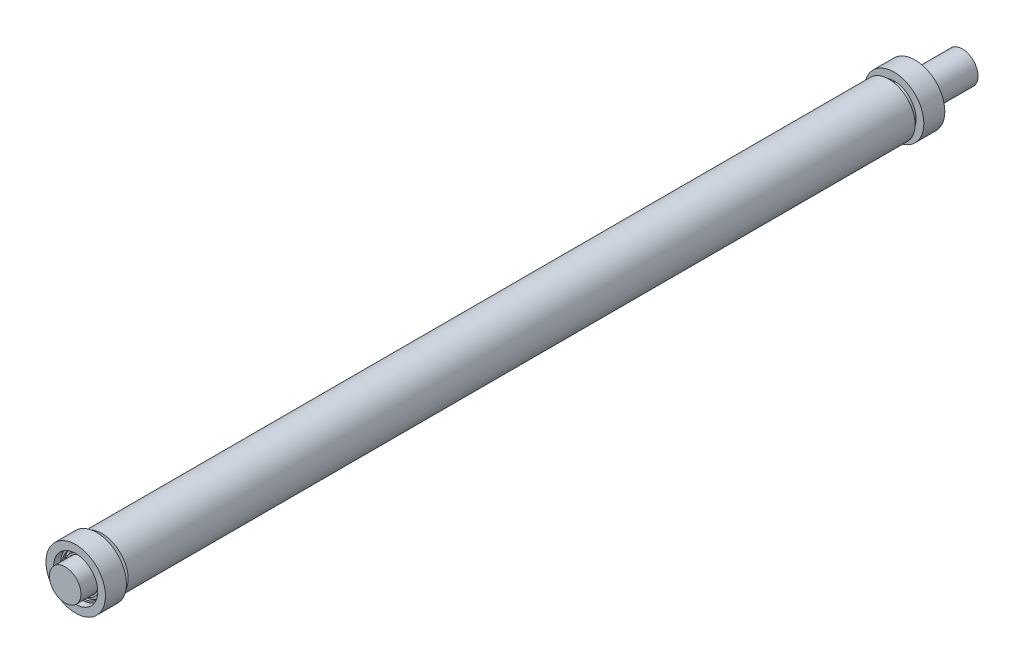
ISO-10303-21;
HEADER;
FILE_DESCRIPTION(('STEP AP214'),'2;1');
FILE_NAME('part.step','',(''),(''),'','','');
FILE_SCHEMA(('AUTOMOTIVE_DESIGN { 1 0 10303 214 1 1 1 1 }'));
ENDSEC;
DATA;
#1=APPLICATION_CONTEXT('core data for automotive mechanical design processes');
#2=APPLICATION_PROTOCOL_DEFINITION('international standard','automotive_design',2000,#1);
#3=PRODUCT_CONTEXT('',#1,'mechanical');
#4=PRODUCT('Part','Part','',(#3));
#5=PRODUCT_RELATED_PRODUCT_CATEGORY('part','',(#4));
#6=PRODUCT_DEFINITION_FORMATION('','',#4);
#7=PRODUCT_DEFINITION_CONTEXT('part definition',#1,'design');
#8=PRODUCT_DEFINITION('design','',#6,#7);
#9=PRODUCT_DEFINITION_SHAPE('','',#8);
#10=(LENGTH_UNIT() NAMED_UNIT(*) SI_UNIT(.MILLI.,.METRE.));
#11=(NAMED_UNIT(*) PLANE_ANGLE_UNIT() SI_UNIT($,.RADIAN.));
#12=(NAMED_UNIT(*) SI_UNIT($,.STERADIAN.) SOLID_ANGLE_UNIT());
#13=UNCERTAINTY_MEASURE_WITH_UNIT(LENGTH_MEASURE(1.E-05),#10,'distance_accuracy_value','');
#14=(GEOMETRIC_REPRESENTATION_CONTEXT(3) GLOBAL_UNCERTAINTY_ASSIGNED_CONTEXT((#13)) GLOBAL_UNIT_ASSIGNED_CONTEXT((#10,
#11,#12)) REPRESENTATION_CONTEXT('',''));
#15=CARTESIAN_POINT('',(0.,0.,0.));
#16=DIRECTION('',(0.,0.,1.));
#17=DIRECTION('',(1.,0.,0.));
#18=AXIS2_PLACEMENT_3D('',#15,#16,#17);
#19=CARTESIAN_POINT('',(0.,0.,750.));
#20=DIRECTION('',(0.,0.,-1.));
#21=DIRECTION('',(-1.,0.,0.));
#22=AXIS2_PLACEMENT_3D('',#19,#20,#21);
#23=CYLINDRICAL_SURFACE('',#22,25.);
#24=CARTESIAN_POINT('',(0.,0.,750.));
#25=DIRECTION('',(0.,0.,1.));
#26=DIRECTION('',(1.,0.,0.));
#27=AXIS2_PLACEMENT_3D('',#24,#25,#26);
#28=CIRCLE('',#27,25.);
#29=CARTESIAN_POINT('',(25.,0.,750.));
#30=VERTEX_POINT('',#29);
#31=EDGE_CURVE('P0_E27',#30,#30,#28,.T.);
#32=ORIENTED_EDGE('',*,*,#31,.F.);
#33=EDGE_LOOP('',(#32));
#34=FACE_BOUND('',#33,.T.);
#35=CARTESIAN_POINT('',(0.,0.,0.));
#36=DIRECTION('',(0.,0.,1.));
#37=DIRECTION('',(1.,0.,0.));
#38=AXIS2_PLACEMENT_3D('',#35,#36,#37);
#39=CIRCLE('',#38,25.);
#40=CARTESIAN_POINT('',(25.,0.,0.));
#41=VERTEX_POINT('',#40);
#42=EDGE_CURVE('P0_E18',#41,#41,#39,.T.);
#43=ORIENTED_EDGE('',*,*,#42,.T.);
#44=EDGE_LOOP('',(#43));
#45=FACE_BOUND('',#44,.T.);
#46=ADVANCED_FACE('P0_F15',(#34,#45),#23,.T.);
#47=CARTESIAN_POINT('',(0.,0.,750.));
#48=DIRECTION('',(0.,0.,1.));
#49=DIRECTION('',(1.,0.,0.));
#50=AXIS2_PLACEMENT_3D('',#47,#48,#49);
#51=PLANE('',#50);
#52=CARTESIAN_POINT('',(0.,0.,750.));
#53=DIRECTION('',(0.,0.,1.));
#54=DIRECTION('',(1.,0.,0.));
#55=AXIS2_PLACEMENT_3D('',#52,#53,#54);
#56=CIRCLE('',#55,15.);
#57=CARTESIAN_POINT('',(15.,0.,750.));
#58=VERTEX_POINT('',#57);
#59=EDGE_CURVE('P0_E10',#58,#58,#56,.T.);
#60=ORIENTED_EDGE('',*,*,#59,.F.);
#61=EDGE_LOOP('',(#60));
#62=FACE_BOUND('',#61,.T.);
#63=ORIENTED_EDGE('',*,*,#31,.T.);
#64=EDGE_LOOP('',(#63));
#65=FACE_BOUND('',#64,.T.);
#66=ADVANCED_FACE('P0_F44',(#62,#65),#51,.T.);
#67=CARTESIAN_POINT('',(0.,0.,0.));
#68=DIRECTION('',(0.,0.,1.));
#69=DIRECTION('',(1.,0.,0.));
#70=AXIS2_PLACEMENT_3D('',#67,#68,#69);
#71=PLANE('',#70);
#72=CARTESIAN_POINT('',(0.,0.,0.));
#73=DIRECTION('',(0.,0.,-1.));
#74=DIRECTION('',(-1.,0.,0.));
#75=AXIS2_PLACEMENT_3D('',#72,#73,#74);
#76=CIRCLE('',#75,15.);
#77=CARTESIAN_POINT('',(-15.,0.,0.));
#78=VERTEX_POINT('',#77);
#79=EDGE_CURVE('P0_E22',#78,#78,#76,.T.);
#80=ORIENTED_EDGE('',*,*,#79,.F.);
#81=EDGE_LOOP('',(#80));
#82=FACE_BOUND('',#81,.T.);
#83=ORIENTED_EDGE('',*,*,#42,.F.);
#84=EDGE_LOOP('',(#83));
#85=FACE_BOUND('',#84,.T.);
#86=ADVANCED_FACE('P0_F41',(#82,#85),#71,.F.);
#87=CARTESIAN_POINT('',(0.,0.,-70.));
#88=DIRECTION('',(0.,0.,1.));
#89=DIRECTION('',(1.,0.,0.));
#90=AXIS2_PLACEMENT_3D('',#87,#88,#89);
#91=CYLINDRICAL_SURFACE('',#90,15.);
#92=CARTESIAN_POINT('',(0.,0.,-70.));
#93=DIRECTION('',(0.,0.,-1.));
#94=DIRECTION('',(-1.,0.,0.));
#95=AXIS2_PLACEMENT_3D('',#92,#93,#94);
#96=CIRCLE('',#95,15.);
#97=CARTESIAN_POINT('',(-15.,0.,-70.));
#98=VERTEX_POINT('',#97);
#99=EDGE_CURVE('P0_E32',#98,#98,#96,.T.);
#100=ORIENTED_EDGE('',*,*,#99,.F.);
#101=EDGE_LOOP('',(#100));
#102=FACE_BOUND('',#101,.T.);
#103=ORIENTED_EDGE('',*,*,#79,.T.);
#104=EDGE_LOOP('',(#103));
#105=FACE_BOUND('',#104,.T.);
#106=ADVANCED_FACE('P0_F43',(#102,#105),#91,.T.);
#107=CARTESIAN_POINT('',(0.,0.,-70.));
#108=DIRECTION('',(0.,0.,-1.));
#109=DIRECTION('',(-1.,0.,0.));
#110=AXIS2_PLACEMENT_3D('',#107,#108,#109);
#111=PLANE('',#110);
#112=ORIENTED_EDGE('',*,*,#99,.T.);
#113=EDGE_LOOP('',(#112));
#114=FACE_BOUND('',#113,.T.);
#115=ADVANCED_FACE('P0_F51',(#114),#111,.T.);
#116=CARTESIAN_POINT('',(0.,0.,785.));
#117=DIRECTION('',(0.,0.,-1.));
#118=DIRECTION('',(-1.,0.,0.));
#119=AXIS2_PLACEMENT_3D('',#116,#117,#118);
#120=CYLINDRICAL_SURFACE('',#119,15.);
#121=CARTESIAN_POINT('',(0.,0.,785.));
#122=DIRECTION('',(0.,0.,1.));
#123=DIRECTION('',(1.,0.,0.));
#124=AXIS2_PLACEMENT_3D('',#121,#122,#123);
#125=CIRCLE('',#124,15.);
#126=CARTESIAN_POINT('',(15.,0.,785.));
#127=VERTEX_POINT('',#126);
#128=EDGE_CURVE('P0_E31',#127,#127,#125,.T.);
#129=ORIENTED_EDGE('',*,*,#128,.F.);
#130=EDGE_LOOP('',(#129));
#131=FACE_BOUND('',#130,.T.);
#132=ORIENTED_EDGE('',*,*,#59,.T.);
#133=EDGE_LOOP('',(#132));
#134=FACE_BOUND('',#133,.T.);
#135=ADVANCED_FACE('P0_F91',(#131,#134),#120,.T.);
#136=CARTESIAN_POINT('',(0.,0.,785.));
#137=DIRECTION('',(0.,0.,1.));
#138=DIRECTION('',(1.,0.,0.));
#139=AXIS2_PLACEMENT_3D('',#136,#137,#138);
#140=PLANE('',#139);
#141=ORIENTED_EDGE('',*,*,#128,.T.);
#142=EDGE_LOOP('',(#141));
#143=FACE_BOUND('',#142,.T.);
#144=ADVANCED_FACE('P0_F101',(#143),#140,.T.);
#145=CLOSED_SHELL('',(#46,#66,#86,#106,#115,#135,#144));
#146=MANIFOLD_SOLID_BREP('P0_B1',#145);
#147=CARTESIAN_POINT('',(0.,0.,-15.));
#148=DIRECTION('',(0.,0.,-1.));
#149=DIRECTION('',(-1.,0.,0.));
#150=AXIS2_PLACEMENT_3D('',#147,#148,#149);
#151=TOROIDAL_SURFACE('',#150,18.,1.8);
#152=CARTESIAN_POINT('',(0.,0.,-13.6583592135001));
#153=DIRECTION('',(0.,0.,-1.));
#154=DIRECTION('',(-1.,0.,0.));
#155=AXIS2_PLACEMENT_3D('',#152,#153,#154);
#156=CIRCLE('',#155,19.2);
#157=CARTESIAN_POINT('',(-19.2,0.,-13.6583592135001));
#158=VERTEX_POINT('',#157);
#159=EDGE_CURVE('P1_E18',#158,#158,#156,.F.);
#160=ORIENTED_EDGE('',*,*,#159,.T.);
#161=EDGE_LOOP('',(#160));
#162=FACE_BOUND('',#161,.T.);
#163=CARTESIAN_POINT('',(0.,0.,-13.6583592135001));
#164=DIRECTION('',(0.,0.,-1.));
#165=DIRECTION('',(-1.,0.,0.));
#166=AXIS2_PLACEMENT_3D('',#163,#164,#165);
#167=CIRCLE('',#166,16.8);
#168=CARTESIAN_POINT('',(-16.8,0.,-13.6583592135001));
#169=VERTEX_POINT('',#168);
#170=EDGE_CURVE('P1_E9',#169,#169,#167,.T.);
#171=ORIENTED_EDGE('',*,*,#170,.T.);
#172=EDGE_LOOP('',(#171));
#173=FACE_BOUND('',#172,.T.);
#174=ADVANCED_FACE('P1_F14',(#162,#173),#151,.T.);
#175=CARTESIAN_POINT('',(0.,0.,-35.6375));
#176=DIRECTION('',(0.,0.,1.));
#177=DIRECTION('',(1.,0.,0.));
#178=AXIS2_PLACEMENT_3D('',#175,#176,#177);
#179=CYLINDRICAL_SURFACE('',#178,16.8);
#180=CARTESIAN_POINT('',(0.,0.,-11.5));
#181=DIRECTION('',(0.,0.,1.));
#182=DIRECTION('',(1.,0.,0.));
#183=AXIS2_PLACEMENT_3D('',#180,#181,#182);
#184=CIRCLE('',#183,16.8);
#185=CARTESIAN_POINT('',(16.8,0.,-11.5));
#186=VERTEX_POINT('',#185);
#187=EDGE_CURVE('P1_E27',#186,#186,#184,.T.);
#188=ORIENTED_EDGE('',*,*,#187,.F.);
#189=EDGE_LOOP('',(#188));
#190=FACE_BOUND('',#189,.T.);
#191=ORIENTED_EDGE('',*,*,#170,.F.);
#192=EDGE_LOOP('',(#191));
#193=FACE_BOUND('',#192,.T.);
#194=ADVANCED_FACE('P1_F66',(#190,#193),#179,.T.);
#195=CARTESIAN_POINT('',(0.,0.,-35.6375));
#196=DIRECTION('',(0.,0.,1.));
#197=DIRECTION('',(1.,0.,0.));
#198=AXIS2_PLACEMENT_3D('',#195,#196,#197);
#199=CYLINDRICAL_SURFACE('',#198,16.8);
#200=CARTESIAN_POINT('',(0.,0.,-18.5));
#201=DIRECTION('',(0.,0.,1.));
#202=DIRECTION('',(1.,0.,0.));
#203=AXIS2_PLACEMENT_3D('',#200,#201,#202);
#204=CIRCLE('',#203,16.8);
#205=CARTESIAN_POINT('',(16.8,0.,-18.5));
#206=VERTEX_POINT('',#205);
#207=EDGE_CURVE('P1_E36',#206,#206,#204,.T.);
#208=ORIENTED_EDGE('',*,*,#207,.T.);
#209=EDGE_LOOP('',(#208));
#210=FACE_BOUND('',#209,.T.);
#211=CARTESIAN_POINT('',(0.,0.,-16.3416407864999));
#212=DIRECTION('',(0.,0.,1.));
#213=DIRECTION('',(1.,0.,0.));
#214=AXIS2_PLACEMENT_3D('',#211,#212,#213);
#215=CIRCLE('',#214,16.8);
#216=CARTESIAN_POINT('',(16.8,0.,-16.3416407864999));
#217=VERTEX_POINT('',#216);
#218=EDGE_CURVE('P1_E22',#217,#217,#215,.T.);
#219=ORIENTED_EDGE('',*,*,#218,.F.);
#220=EDGE_LOOP('',(#219));
#221=FACE_BOUND('',#220,.T.);
#222=ADVANCED_FACE('P1_F69',(#210,#221),#199,.T.);
#223=CARTESIAN_POINT('',(0.,15.3,-11.5));
#224=DIRECTION('',(0.,0.,1.));
#225=DIRECTION('',(1.,0.,0.));
#226=AXIS2_PLACEMENT_3D('',#223,#224,#225);
#227=PLANE('',#226);
#228=ORIENTED_EDGE('',*,*,#187,.T.);
#229=EDGE_LOOP('',(#228));
#230=FACE_BOUND('',#229,.T.);
#231=CARTESIAN_POINT('',(0.,0.,-11.5));
#232=DIRECTION('',(0.,0.,1.));
#233=DIRECTION('',(1.,0.,0.));
#234=AXIS2_PLACEMENT_3D('',#231,#232,#233);
#235=CIRCLE('',#234,15.3);
#236=CARTESIAN_POINT('',(15.3,0.,-11.5));
#237=VERTEX_POINT('',#236);
#238=EDGE_CURVE('P1_E58',#237,#237,#235,.T.);
#239=ORIENTED_EDGE('',*,*,#238,.F.);
#240=EDGE_LOOP('',(#239));
#241=FACE_BOUND('',#240,.T.);
#242=ADVANCED_FACE('P1_F63',(#230,#241),#227,.T.);
#243=CARTESIAN_POINT('',(0.,0.,-11.8));
#244=DIRECTION('',(0.,0.,1.));
#245=DIRECTION('',(1.,0.,0.));
#246=AXIS2_PLACEMENT_3D('',#243,#244,#245);
#247=TOROIDAL_SURFACE('',#246,15.3,0.3);
#248=ORIENTED_EDGE('',*,*,#238,.T.);
#249=EDGE_LOOP('',(#248));
#250=FACE_BOUND('',#249,.T.);
#251=CARTESIAN_POINT('',(0.,0.,-11.8));
#252=DIRECTION('',(0.,0.,1.));
#253=DIRECTION('',(1.,0.,0.));
#254=AXIS2_PLACEMENT_3D('',#251,#252,#253);
#255=CIRCLE('',#254,15.);
#256=CARTESIAN_POINT('',(15.,0.,-11.8));
#257=VERTEX_POINT('',#256);
#258=EDGE_CURVE('P1_E55',#257,#257,#255,.T.);
#259=ORIENTED_EDGE('',*,*,#258,.F.);
#260=EDGE_LOOP('',(#259));
#261=FACE_BOUND('',#260,.T.);
#262=ADVANCED_FACE('P1_F81',(#250,#261),#247,.T.);
#263=CARTESIAN_POINT('',(0.,0.,-35.6375));
#264=DIRECTION('',(0.,0.,1.));
#265=DIRECTION('',(1.,0.,0.));
#266=AXIS2_PLACEMENT_3D('',#263,#264,#265);
#267=CYLINDRICAL_SURFACE('',#266,15.);
#268=ORIENTED_EDGE('',*,*,#258,.T.);
#269=EDGE_LOOP('',(#268));
#270=FACE_BOUND('',#269,.T.);
#271=CARTESIAN_POINT('',(0.,0.,-18.2));
#272=DIRECTION('',(0.,0.,1.));
#273=DIRECTION('',(1.,0.,0.));
#274=AXIS2_PLACEMENT_3D('',#271,#272,#273);
#275=CIRCLE('',#274,15.);
#276=CARTESIAN_POINT('',(15.,0.,-18.2));
#277=VERTEX_POINT('',#276);
#278=EDGE_CURVE('P1_E52',#277,#277,#275,.T.);
#279=ORIENTED_EDGE('',*,*,#278,.F.);
#280=EDGE_LOOP('',(#279));
#281=FACE_BOUND('',#280,.T.);
#282=ADVANCED_FACE('P1_F84',(#270,#281),#267,.F.);
#283=CARTESIAN_POINT('',(0.,0.,-18.2));
#284=DIRECTION('',(0.,0.,1.));
#285=DIRECTION('',(1.,0.,0.));
#286=AXIS2_PLACEMENT_3D('',#283,#284,#285);
#287=TOROIDAL_SURFACE('',#286,15.3,0.3);
#288=ORIENTED_EDGE('',*,*,#278,.T.);
#289=EDGE_LOOP('',(#288));
#290=FACE_BOUND('',#289,.T.);
#291=CARTESIAN_POINT('',(0.,0.,-18.5));
#292=DIRECTION('',(0.,0.,1.));
#293=DIRECTION('',(1.,0.,0.));
#294=AXIS2_PLACEMENT_3D('',#291,#292,#293);
#295=CIRCLE('',#294,15.3);
#296=CARTESIAN_POINT('',(15.3,0.,-18.5));
#297=VERTEX_POINT('',#296);
#298=EDGE_CURVE('P1_E49',#297,#297,#295,.T.);
#299=ORIENTED_EDGE('',*,*,#298,.F.);
#300=EDGE_LOOP('',(#299));
#301=FACE_BOUND('',#300,.T.);
#302=ADVANCED_FACE('P1_F88',(#290,#301),#287,.T.);
#303=CARTESIAN_POINT('',(0.,16.8,-18.5));
#304=DIRECTION('',(0.,0.,-1.));
#305=DIRECTION('',(-1.,0.,0.));
#306=AXIS2_PLACEMENT_3D('',#303,#304,#305);
#307=PLANE('',#306);
#308=ORIENTED_EDGE('',*,*,#298,.T.);
#309=EDGE_LOOP('',(#308));
#310=FACE_BOUND('',#309,.T.);
#311=ORIENTED_EDGE('',*,*,#207,.F.);
#312=EDGE_LOOP('',(#311));
#313=FACE_BOUND('',#312,.T.);
#314=ADVANCED_FACE('P1_F92',(#310,#313),#307,.T.);
#315=CARTESIAN_POINT('',(0.,0.,-16.3416407864999));
#316=DIRECTION('',(0.,0.,1.));
#317=DIRECTION('',(1.,0.,0.));
#318=AXIS2_PLACEMENT_3D('',#315,#316,#317);
#319=CIRCLE('',#318,19.2);
#320=CARTESIAN_POINT('',(19.2,0.,-16.3416407864999));
#321=VERTEX_POINT('',#320);
#322=EDGE_CURVE('P1_E30',#321,#321,#319,.F.);
#323=ORIENTED_EDGE('',*,*,#322,.T.);
#324=EDGE_LOOP('',(#323));
#325=FACE_BOUND('',#324,.T.);
#326=ORIENTED_EDGE('',*,*,#218,.T.);
#327=EDGE_LOOP('',(#326));
#328=FACE_BOUND('',#327,.T.);
#329=ADVANCED_FACE('P1_F16',(#325,#328),#151,.T.);
#330=CARTESIAN_POINT('',(0.,0.,-35.6375));
#331=DIRECTION('',(0.,0.,1.));
#332=DIRECTION('',(1.,0.,0.));
#333=AXIS2_PLACEMENT_3D('',#330,#331,#332);
#334=CYLINDRICAL_SURFACE('',#333,19.2);
#335=CARTESIAN_POINT('',(0.,0.,-11.5));
#336=DIRECTION('',(0.,0.,1.));
#337=DIRECTION('',(1.,0.,0.));
#338=AXIS2_PLACEMENT_3D('',#335,#336,#337);
#339=CIRCLE('',#338,19.2);
#340=CARTESIAN_POINT('',(19.2,0.,-11.5));
#341=VERTEX_POINT('',#340);
#342=EDGE_CURVE('P1_E32',#341,#341,#339,.T.);
#343=ORIENTED_EDGE('',*,*,#342,.T.);
#344=EDGE_LOOP('',(#343));
#345=FACE_BOUND('',#344,.T.);
#346=ORIENTED_EDGE('',*,*,#159,.F.);
#347=EDGE_LOOP('',(#346));
#348=FACE_BOUND('',#347,.T.);
#349=ADVANCED_FACE('P1_F97',(#345,#348),#334,.F.);
#350=CARTESIAN_POINT('',(0.,0.,-35.6375));
#351=DIRECTION('',(0.,0.,1.));
#352=DIRECTION('',(1.,0.,0.));
#353=AXIS2_PLACEMENT_3D('',#350,#351,#352);
#354=CYLINDRICAL_SURFACE('',#353,19.2);
#355=CARTESIAN_POINT('',(0.,0.,-18.5));
#356=DIRECTION('',(0.,0.,1.));
#357=DIRECTION('',(1.,0.,0.));
#358=AXIS2_PLACEMENT_3D('',#355,#356,#357);
#359=CIRCLE('',#358,19.2);
#360=CARTESIAN_POINT('',(19.2,0.,-18.5));
#361=VERTEX_POINT('',#360);
#362=EDGE_CURVE('P1_E128',#361,#361,#359,.T.);
#363=ORIENTED_EDGE('',*,*,#362,.F.);
#364=EDGE_LOOP('',(#363));
#365=FACE_BOUND('',#364,.T.);
#366=ORIENTED_EDGE('',*,*,#322,.F.);
#367=EDGE_LOOP('',(#366));
#368=FACE_BOUND('',#367,.T.);
#369=ADVANCED_FACE('P1_F100',(#365,#368),#354,.F.);
#370=CARTESIAN_POINT('',(0.,20.7,-11.5));
#371=DIRECTION('',(0.,0.,1.));
#372=DIRECTION('',(1.,0.,0.));
#373=AXIS2_PLACEMENT_3D('',#370,#371,#372);
#374=PLANE('',#373);
#375=CARTESIAN_POINT('',(0.,0.,-11.5));
#376=DIRECTION('',(0.,0.,1.));
#377=DIRECTION('',(1.,0.,0.));
#378=AXIS2_PLACEMENT_3D('',#375,#376,#377);
#379=CIRCLE('',#378,20.7);
#380=CARTESIAN_POINT('',(20.7,0.,-11.5));
#381=VERTEX_POINT('',#380);
#382=EDGE_CURVE('P1_E38',#381,#381,#379,.T.);
#383=ORIENTED_EDGE('',*,*,#382,.T.);
#384=EDGE_LOOP('',(#383));
#385=FACE_BOUND('',#384,.T.);
#386=ORIENTED_EDGE('',*,*,#342,.F.);
#387=EDGE_LOOP('',(#386));
#388=FACE_BOUND('',#387,.T.);
#389=ADVANCED_FACE('P1_F101',(#385,#388),#374,.T.);
#390=CARTESIAN_POINT('',(0.,0.,-11.8));
#391=DIRECTION('',(0.,0.,1.));
#392=DIRECTION('',(1.,0.,0.));
#393=AXIS2_PLACEMENT_3D('',#390,#391,#392);
#394=TOROIDAL_SURFACE('',#393,20.7,0.299999999999996);
#395=CARTESIAN_POINT('',(0.,0.,-11.8));
#396=DIRECTION('',(0.,0.,1.));
#397=DIRECTION('',(1.,0.,0.));
#398=AXIS2_PLACEMENT_3D('',#395,#396,#397);
#399=CIRCLE('',#398,21.);
#400=CARTESIAN_POINT('',(21.,0.,-11.8));
#401=VERTEX_POINT('',#400);
#402=EDGE_CURVE('P1_E43',#401,#401,#399,.T.);
#403=ORIENTED_EDGE('',*,*,#402,.T.);
#404=EDGE_LOOP('',(#403));
#405=FACE_BOUND('',#404,.T.);
#406=ORIENTED_EDGE('',*,*,#382,.F.);
#407=EDGE_LOOP('',(#406));
#408=FACE_BOUND('',#407,.T.);
#409=ADVANCED_FACE('P1_F104',(#405,#408),#394,.T.);
#410=CARTESIAN_POINT('',(0.,0.,-35.6375));
#411=DIRECTION('',(0.,0.,1.));
#412=DIRECTION('',(1.,0.,0.));
#413=AXIS2_PLACEMENT_3D('',#410,#411,#412);
#414=CYLINDRICAL_SURFACE('',#413,21.);
#415=CARTESIAN_POINT('',(0.,0.,-18.2));
#416=DIRECTION('',(0.,0.,1.));
#417=DIRECTION('',(1.,0.,0.));
#418=AXIS2_PLACEMENT_3D('',#415,#416,#417);
#419=CIRCLE('',#418,21.);
#420=CARTESIAN_POINT('',(21.,0.,-18.2));
#421=VERTEX_POINT('',#420);
#422=EDGE_CURVE('P1_E132',#421,#421,#419,.T.);
#423=ORIENTED_EDGE('',*,*,#422,.T.);
#424=EDGE_LOOP('',(#423));
#425=FACE_BOUND('',#424,.T.);
#426=ORIENTED_EDGE('',*,*,#402,.F.);
#427=EDGE_LOOP('',(#426));
#428=FACE_BOUND('',#427,.T.);
#429=ADVANCED_FACE('P1_F108',(#425,#428),#414,.T.);
#430=CARTESIAN_POINT('',(0.,0.,-18.2));
#431=DIRECTION('',(0.,0.,1.));
#432=DIRECTION('',(1.,0.,0.));
#433=AXIS2_PLACEMENT_3D('',#430,#431,#432);
#434=TOROIDAL_SURFACE('',#433,20.7,0.299999999999996);
#435=CARTESIAN_POINT('',(0.,0.,-18.5));
#436=DIRECTION('',(0.,0.,1.));
#437=DIRECTION('',(1.,0.,0.));
#438=AXIS2_PLACEMENT_3D('',#435,#436,#437);
#439=CIRCLE('',#438,20.7);
#440=CARTESIAN_POINT('',(20.7,0.,-18.5));
#441=VERTEX_POINT('',#440);
#442=EDGE_CURVE('P1_E129',#441,#441,#439,.T.);
#443=ORIENTED_EDGE('',*,*,#442,.T.);
#444=EDGE_LOOP('',(#443));
#445=FACE_BOUND('',#444,.T.);
#446=ORIENTED_EDGE('',*,*,#422,.F.);
#447=EDGE_LOOP('',(#446));
#448=FACE_BOUND('',#447,.T.);
#449=ADVANCED_FACE('P1_F112',(#445,#448),#434,.T.);
#450=CARTESIAN_POINT('',(0.,19.2,-18.5));
#451=DIRECTION('',(0.,0.,-1.));
#452=DIRECTION('',(-1.,0.,0.));
#453=AXIS2_PLACEMENT_3D('',#450,#451,#452);
#454=PLANE('',#453);
#455=ORIENTED_EDGE('',*,*,#362,.T.);
#456=EDGE_LOOP('',(#455));
#457=FACE_BOUND('',#456,.T.);
#458=ORIENTED_EDGE('',*,*,#442,.F.);
#459=EDGE_LOOP('',(#458));
#460=FACE_BOUND('',#459,.T.);
#461=ADVANCED_FACE('P1_F116',(#457,#460),#454,.T.);
#462=CLOSED_SHELL('',(#174,#194,#222,#242,#262,#282,#302,#314,#329,#349,#369,#389,#409,#429,
#449,#461));
#463=MANIFOLD_SOLID_BREP('P1_B1',#462);
#464=CARTESIAN_POINT('',(0.,0.,-5.));
#465=DIRECTION('',(0.,0.,1.));
#466=DIRECTION('',(1.,0.,0.));
#467=AXIS2_PLACEMENT_3D('',#464,#465,#466);
#468=PLANE('',#467);
#469=CARTESIAN_POINT('',(0.,0.,-5.));
#470=DIRECTION('',(0.,0.,1.));
#471=DIRECTION('',(1.,0.,0.));
#472=AXIS2_PLACEMENT_3D('',#469,#470,#471);
#473=CIRCLE('',#472,28.35);
#474=CARTESIAN_POINT('',(28.35,0.,-5.));
#475=VERTEX_POINT('',#474);
#476=EDGE_CURVE('P2_E10',#475,#475,#473,.T.);
#477=ORIENTED_EDGE('',*,*,#476,.T.);
#478=EDGE_LOOP('',(#477));
#479=FACE_BOUND('',#478,.T.);
#480=CARTESIAN_POINT('',(0.,0.,-5.));
#481=DIRECTION('',(0.,0.,1.));
#482=DIRECTION('',(1.,0.,0.));
#483=AXIS2_PLACEMENT_3D('',#480,#481,#482);
#484=CIRCLE('',#483,21.);
#485=CARTESIAN_POINT('',(21.,0.,-5.));
#486=VERTEX_POINT('',#485);
#487=EDGE_CURVE('P2_E26',#486,#486,#484,.T.);
#488=ORIENTED_EDGE('',*,*,#487,.F.);
#489=EDGE_LOOP('',(#488));
#490=FACE_BOUND('',#489,.T.);
#491=ADVANCED_FACE('P2_F15',(#479,#490),#468,.T.);
#492=CARTESIAN_POINT('',(0.,0.,-25.));
#493=DIRECTION('',(0.,0.,1.));
#494=DIRECTION('',(1.,0.,0.));
#495=AXIS2_PLACEMENT_3D('',#492,#493,#494);
#496=PLANE('',#495);
#497=CARTESIAN_POINT('',(0.,0.,-25.));
#498=DIRECTION('',(0.,0.,1.));
#499=DIRECTION('',(1.,0.,0.));
#500=AXIS2_PLACEMENT_3D('',#497,#498,#499);
#501=CIRCLE('',#500,28.35);
#502=CARTESIAN_POINT('',(28.35,0.,-25.));
#503=VERTEX_POINT('',#502);
#504=EDGE_CURVE('P2_E19',#503,#503,#501,.T.);
#505=ORIENTED_EDGE('',*,*,#504,.F.);
#506=EDGE_LOOP('',(#505));
#507=FACE_BOUND('',#506,.T.);
#508=CARTESIAN_POINT('',(0.,0.,-25.));
#509=DIRECTION('',(0.,0.,1.));
#510=DIRECTION('',(1.,0.,0.));
#511=AXIS2_PLACEMENT_3D('',#508,#509,#510);
#512=CIRCLE('',#511,21.);
#513=CARTESIAN_POINT('',(21.,0.,-25.));
#514=VERTEX_POINT('',#513);
#515=EDGE_CURVE('P2_E28',#514,#514,#512,.T.);
#516=ORIENTED_EDGE('',*,*,#515,.T.);
#517=EDGE_LOOP('',(#516));
#518=FACE_BOUND('',#517,.T.);
#519=ADVANCED_FACE('P2_F38',(#507,#518),#496,.F.);
#520=CARTESIAN_POINT('',(0.,0.,-5.));
#521=DIRECTION('',(0.,0.,-1.));
#522=DIRECTION('',(-1.,0.,0.));
#523=AXIS2_PLACEMENT_3D('',#520,#521,#522);
#524=CYLINDRICAL_SURFACE('',#523,28.35);
#525=ORIENTED_EDGE('',*,*,#476,.F.);
#526=EDGE_LOOP('',(#525));
#527=FACE_BOUND('',#526,.T.);
#528=ORIENTED_EDGE('',*,*,#504,.T.);
#529=EDGE_LOOP('',(#528));
#530=FACE_BOUND('',#529,.T.);
#531=ADVANCED_FACE('P2_F17',(#527,#530),#524,.T.);
#532=CARTESIAN_POINT('',(0.,0.,-5.));
#533=DIRECTION('',(0.,0.,-1.));
#534=DIRECTION('',(-1.,0.,0.));
#535=AXIS2_PLACEMENT_3D('',#532,#533,#534);
#536=CYLINDRICAL_SURFACE('',#535,21.);
#537=ORIENTED_EDGE('',*,*,#487,.T.);
#538=EDGE_LOOP('',(#537));
#539=FACE_BOUND('',#538,.T.);
#540=ORIENTED_EDGE('',*,*,#515,.F.);
#541=EDGE_LOOP('',(#540));
#542=FACE_BOUND('',#541,.T.);
#543=ADVANCED_FACE('P2_F34',(#539,#542),#536,.F.);
#544=CLOSED_SHELL('',(#491,#519,#531,#543));
#545=MANIFOLD_SOLID_BREP('P2_B1',#544);
#546=CARTESIAN_POINT('',(0.,0.,765.));
#547=DIRECTION('',(0.,0.,-1.));
#548=DIRECTION('',(-1.,0.,0.));
#549=AXIS2_PLACEMENT_3D('',#546,#547,#548);
#550=TOROIDAL_SURFACE('',#549,18.,1.8);
#551=CARTESIAN_POINT('',(0.,0.,766.3416407865));
#552=DIRECTION('',(0.,0.,-1.));
#553=DIRECTION('',(-1.,0.,0.));
#554=AXIS2_PLACEMENT_3D('',#551,#552,#553);
#555=CIRCLE('',#554,19.2);
#556=CARTESIAN_POINT('',(-19.2,0.,766.3416407865));
#557=VERTEX_POINT('',#556);
#558=EDGE_CURVE('P3_E19',#557,#557,#555,.F.);
#559=ORIENTED_EDGE('',*,*,#558,.T.);
#560=EDGE_LOOP('',(#559));
#561=FACE_BOUND('',#560,.T.);
#562=CARTESIAN_POINT('',(0.,0.,766.3416407865));
#563=DIRECTION('',(0.,0.,-1.));
#564=DIRECTION('',(-1.,0.,0.));
#565=AXIS2_PLACEMENT_3D('',#562,#563,#564);
#566=CIRCLE('',#565,16.8);
#567=CARTESIAN_POINT('',(-16.8,0.,766.3416407865));
#568=VERTEX_POINT('',#567);
#569=EDGE_CURVE('P3_E10',#568,#568,#566,.T.);
#570=ORIENTED_EDGE('',*,*,#569,.T.);
#571=EDGE_LOOP('',(#570));
#572=FACE_BOUND('',#571,.T.);
#573=ADVANCED_FACE('P3_F15',(#561,#572),#550,.T.);
#574=CARTESIAN_POINT('',(0.,0.,744.3625));
#575=DIRECTION('',(0.,0.,1.));
#576=DIRECTION('',(1.,0.,0.));
#577=AXIS2_PLACEMENT_3D('',#574,#575,#576);
#578=CYLINDRICAL_SURFACE('',#577,16.8);
#579=CARTESIAN_POINT('',(0.,0.,768.5));
#580=DIRECTION('',(0.,0.,1.));
#581=DIRECTION('',(1.,0.,0.));
#582=AXIS2_PLACEMENT_3D('',#579,#580,#581);
#583=CIRCLE('',#582,16.8);
#584=CARTESIAN_POINT('',(16.8,0.,768.5));
#585=VERTEX_POINT('',#584);
#586=EDGE_CURVE('P3_E28',#585,#585,#583,.T.);
#587=ORIENTED_EDGE('',*,*,#586,.F.);
#588=EDGE_LOOP('',(#587));
#589=FACE_BOUND('',#588,.T.);
#590=ORIENTED_EDGE('',*,*,#569,.F.);
#591=EDGE_LOOP('',(#590));
#592=FACE_BOUND('',#591,.T.);
#593=ADVANCED_FACE('P3_F67',(#589,#592),#578,.T.);
#594=CARTESIAN_POINT('',(0.,0.,744.3625));
#595=DIRECTION('',(0.,0.,1.));
#596=DIRECTION('',(1.,0.,0.));
#597=AXIS2_PLACEMENT_3D('',#594,#595,#596);
#598=CYLINDRICAL_SURFACE('',#597,16.8);
#599=CARTESIAN_POINT('',(0.,0.,761.5));
#600=DIRECTION('',(0.,0.,1.));
#601=DIRECTION('',(1.,0.,0.));
#602=AXIS2_PLACEMENT_3D('',#599,#600,#601);
#603=CIRCLE('',#602,16.8);
#604=CARTESIAN_POINT('',(16.8,0.,761.5));
#605=VERTEX_POINT('',#604);
#606=EDGE_CURVE('P3_E37',#605,#605,#603,.T.);
#607=ORIENTED_EDGE('',*,*,#606,.T.);
#608=EDGE_LOOP('',(#607));
#609=FACE_BOUND('',#608,.T.);
#610=CARTESIAN_POINT('',(0.,0.,763.6583592135));
#611=DIRECTION('',(0.,0.,1.));
#612=DIRECTION('',(1.,0.,0.));
#613=AXIS2_PLACEMENT_3D('',#610,#611,#612);
#614=CIRCLE('',#613,16.8);
#615=CARTESIAN_POINT('',(16.8,0.,763.6583592135));
#616=VERTEX_POINT('',#615);
#617=EDGE_CURVE('P3_E23',#616,#616,#614,.T.);
#618=ORIENTED_EDGE('',*,*,#617,.F.);
#619=EDGE_LOOP('',(#618));
#620=FACE_BOUND('',#619,.T.);
#621=ADVANCED_FACE('P3_F70',(#609,#620),#598,.T.);
#622=CARTESIAN_POINT('',(0.,15.3,768.5));
#623=DIRECTION('',(0.,0.,1.));
#624=DIRECTION('',(1.,0.,0.));
#625=AXIS2_PLACEMENT_3D('',#622,#623,#624);
#626=PLANE('',#625);
#627=ORIENTED_EDGE('',*,*,#586,.T.);
#628=EDGE_LOOP('',(#627));
#629=FACE_BOUND('',#628,.T.);
#630=CARTESIAN_POINT('',(0.,0.,768.5));
#631=DIRECTION('',(0.,0.,1.));
#632=DIRECTION('',(1.,0.,0.));
#633=AXIS2_PLACEMENT_3D('',#630,#631,#632);
#634=CIRCLE('',#633,15.3);
#635=CARTESIAN_POINT('',(15.3,0.,768.5));
#636=VERTEX_POINT('',#635);
#637=EDGE_CURVE('P3_E59',#636,#636,#634,.T.);
#638=ORIENTED_EDGE('',*,*,#637,.F.);
#639=EDGE_LOOP('',(#638));
#640=FACE_BOUND('',#639,.T.);
#641=ADVANCED_FACE('P3_F64',(#629,#640),#626,.T.);
#642=CARTESIAN_POINT('',(0.,0.,768.2));
#643=DIRECTION('',(0.,0.,1.));
#644=DIRECTION('',(1.,0.,0.));
#645=AXIS2_PLACEMENT_3D('',#642,#643,#644);
#646=TOROIDAL_SURFACE('',#645,15.3,0.3);
#647=ORIENTED_EDGE('',*,*,#637,.T.);
#648=EDGE_LOOP('',(#647));
#649=FACE_BOUND('',#648,.T.);
#650=CARTESIAN_POINT('',(0.,0.,768.2));
#651=DIRECTION('',(0.,0.,1.));
#652=DIRECTION('',(1.,0.,0.));
#653=AXIS2_PLACEMENT_3D('',#650,#651,#652);
#654=CIRCLE('',#653,15.);
#655=CARTESIAN_POINT('',(15.,0.,768.2));
#656=VERTEX_POINT('',#655);
#657=EDGE_CURVE('P3_E56',#656,#656,#654,.T.);
#658=ORIENTED_EDGE('',*,*,#657,.F.);
#659=EDGE_LOOP('',(#658));
#660=FACE_BOUND('',#659,.T.);
#661=ADVANCED_FACE('P3_F82',(#649,#660),#646,.T.);
#662=CARTESIAN_POINT('',(0.,0.,744.3625));
#663=DIRECTION('',(0.,0.,1.));
#664=DIRECTION('',(1.,0.,0.));
#665=AXIS2_PLACEMENT_3D('',#662,#663,#664);
#666=CYLINDRICAL_SURFACE('',#665,15.);
#667=ORIENTED_EDGE('',*,*,#657,.T.);
#668=EDGE_LOOP('',(#667));
#669=FACE_BOUND('',#668,.T.);
#670=CARTESIAN_POINT('',(0.,0.,761.8));
#671=DIRECTION('',(0.,0.,1.));
#672=DIRECTION('',(1.,0.,0.));
#673=AXIS2_PLACEMENT_3D('',#670,#671,#672);
#674=CIRCLE('',#673,15.);
#675=CARTESIAN_POINT('',(15.,0.,761.8));
#676=VERTEX_POINT('',#675);
#677=EDGE_CURVE('P3_E53',#676,#676,#674,.T.);
#678=ORIENTED_EDGE('',*,*,#677,.F.);
#679=EDGE_LOOP('',(#678));
#680=FACE_BOUND('',#679,.T.);
#681=ADVANCED_FACE('P3_F85',(#669,#680),#666,.F.);
#682=CARTESIAN_POINT('',(0.,0.,761.8));
#683=DIRECTION('',(0.,0.,1.));
#684=DIRECTION('',(1.,0.,0.));
#685=AXIS2_PLACEMENT_3D('',#682,#683,#684);
#686=TOROIDAL_SURFACE('',#685,15.3,0.3);
#687=ORIENTED_EDGE('',*,*,#677,.T.);
#688=EDGE_LOOP('',(#687));
#689=FACE_BOUND('',#688,.T.);
#690=CARTESIAN_POINT('',(0.,0.,761.5));
#691=DIRECTION('',(0.,0.,1.));
#692=DIRECTION('',(1.,0.,0.));
#693=AXIS2_PLACEMENT_3D('',#690,#691,#692);
#694=CIRCLE('',#693,15.3);
#695=CARTESIAN_POINT('',(15.3,0.,761.5));
#696=VERTEX_POINT('',#695);
#697=EDGE_CURVE('P3_E50',#696,#696,#694,.T.);
#698=ORIENTED_EDGE('',*,*,#697,.F.);
#699=EDGE_LOOP('',(#698));
#700=FACE_BOUND('',#699,.T.);
#701=ADVANCED_FACE('P3_F89',(#689,#700),#686,.T.);
#702=CARTESIAN_POINT('',(0.,16.8,761.5));
#703=DIRECTION('',(0.,0.,-1.));
#704=DIRECTION('',(-1.,0.,0.));
#705=AXIS2_PLACEMENT_3D('',#702,#703,#704);
#706=PLANE('',#705);
#707=ORIENTED_EDGE('',*,*,#697,.T.);
#708=EDGE_LOOP('',(#707));
#709=FACE_BOUND('',#708,.T.);
#710=ORIENTED_EDGE('',*,*,#606,.F.);
#711=EDGE_LOOP('',(#710));
#712=FACE_BOUND('',#711,.T.);
#713=ADVANCED_FACE('P3_F93',(#709,#712),#706,.T.);
#714=CARTESIAN_POINT('',(0.,0.,763.6583592135));
#715=DIRECTION('',(0.,0.,1.));
#716=DIRECTION('',(1.,0.,0.));
#717=AXIS2_PLACEMENT_3D('',#714,#715,#716);
#718=CIRCLE('',#717,19.2);
#719=CARTESIAN_POINT('',(19.2,0.,763.6583592135));
#720=VERTEX_POINT('',#719);
#721=EDGE_CURVE('P3_E31',#720,#720,#718,.F.);
#722=ORIENTED_EDGE('',*,*,#721,.T.);
#723=EDGE_LOOP('',(#722));
#724=FACE_BOUND('',#723,.T.);
#725=ORIENTED_EDGE('',*,*,#617,.T.);
#726=EDGE_LOOP('',(#725));
#727=FACE_BOUND('',#726,.T.);
#728=ADVANCED_FACE('P3_F17',(#724,#727),#550,.T.);
#729=CARTESIAN_POINT('',(0.,0.,744.3625));
#730=DIRECTION('',(0.,0.,1.));
#731=DIRECTION('',(1.,0.,0.));
#732=AXIS2_PLACEMENT_3D('',#729,#730,#731);
#733=CYLINDRICAL_SURFACE('',#732,19.2);
#734=CARTESIAN_POINT('',(0.,0.,768.5));
#735=DIRECTION('',(0.,0.,1.));
#736=DIRECTION('',(1.,0.,0.));
#737=AXIS2_PLACEMENT_3D('',#734,#735,#736);
#738=CIRCLE('',#737,19.2);
#739=CARTESIAN_POINT('',(19.2,0.,768.5));
#740=VERTEX_POINT('',#739);
#741=EDGE_CURVE('P3_E33',#740,#740,#738,.T.);
#742=ORIENTED_EDGE('',*,*,#741,.T.);
#743=EDGE_LOOP('',(#742));
#744=FACE_BOUND('',#743,.T.);
#745=ORIENTED_EDGE('',*,*,#558,.F.);
#746=EDGE_LOOP('',(#745));
#747=FACE_BOUND('',#746,.T.);
#748=ADVANCED_FACE('P3_F98',(#744,#747),#733,.F.);
#749=CARTESIAN_POINT('',(0.,0.,744.3625));
#750=DIRECTION('',(0.,0.,1.));
#751=DIRECTION('',(1.,0.,0.));
#752=AXIS2_PLACEMENT_3D('',#749,#750,#751);
#753=CYLINDRICAL_SURFACE('',#752,19.2);
#754=CARTESIAN_POINT('',(0.,0.,761.5));
#755=DIRECTION('',(0.,0.,1.));
#756=DIRECTION('',(1.,0.,0.));
#757=AXIS2_PLACEMENT_3D('',#754,#755,#756);
#758=CIRCLE('',#757,19.2);
#759=CARTESIAN_POINT('',(19.2,0.,761.5));
#760=VERTEX_POINT('',#759);
#761=EDGE_CURVE('P3_E129',#760,#760,#758,.T.);
#762=ORIENTED_EDGE('',*,*,#761,.F.);
#763=EDGE_LOOP('',(#762));
#764=FACE_BOUND('',#763,.T.);
#765=ORIENTED_EDGE('',*,*,#721,.F.);
#766=EDGE_LOOP('',(#765));
#767=FACE_BOUND('',#766,.T.);
#768=ADVANCED_FACE('P3_F101',(#764,#767),#753,.F.);
#769=CARTESIAN_POINT('',(0.,20.7,768.5));
#770=DIRECTION('',(0.,0.,1.));
#771=DIRECTION('',(1.,0.,0.));
#772=AXIS2_PLACEMENT_3D('',#769,#770,#771);
#773=PLANE('',#772);
#774=CARTESIAN_POINT('',(0.,0.,768.5));
#775=DIRECTION('',(0.,0.,1.));
#776=DIRECTION('',(1.,0.,0.));
#777=AXIS2_PLACEMENT_3D('',#774,#775,#776);
#778=CIRCLE('',#777,20.7);
#779=CARTESIAN_POINT('',(20.7,0.,768.5));
#780=VERTEX_POINT('',#779);
#781=EDGE_CURVE('P3_E39',#780,#780,#778,.T.);
#782=ORIENTED_EDGE('',*,*,#781,.T.);
#783=EDGE_LOOP('',(#782));
#784=FACE_BOUND('',#783,.T.);
#785=ORIENTED_EDGE('',*,*,#741,.F.);
#786=EDGE_LOOP('',(#785));
#787=FACE_BOUND('',#786,.T.);
#788=ADVANCED_FACE('P3_F102',(#784,#787),#773,.T.);
#789=CARTESIAN_POINT('',(0.,0.,768.2));
#790=DIRECTION('',(0.,0.,1.));
#791=DIRECTION('',(1.,0.,0.));
#792=AXIS2_PLACEMENT_3D('',#789,#790,#791);
#793=TOROIDAL_SURFACE('',#792,20.7,0.299999999999996);
#794=CARTESIAN_POINT('',(0.,0.,768.2));
#795=DIRECTION('',(0.,0.,1.));
#796=DIRECTION('',(1.,0.,0.));
#797=AXIS2_PLACEMENT_3D('',#794,#795,#796);
#798=CIRCLE('',#797,21.);
#799=CARTESIAN_POINT('',(21.,0.,768.2));
#800=VERTEX_POINT('',#799);
#801=EDGE_CURVE('P3_E44',#800,#800,#798,.T.);
#802=ORIENTED_EDGE('',*,*,#801,.T.);
#803=EDGE_LOOP('',(#802));
#804=FACE_BOUND('',#803,.T.);
#805=ORIENTED_EDGE('',*,*,#781,.F.);
#806=EDGE_LOOP('',(#805));
#807=FACE_BOUND('',#806,.T.);
#808=ADVANCED_FACE('P3_F105',(#804,#807),#793,.T.);
#809=CARTESIAN_POINT('',(0.,0.,744.3625));
#810=DIRECTION('',(0.,0.,1.));
#811=DIRECTION('',(1.,0.,0.));
#812=AXIS2_PLACEMENT_3D('',#809,#810,#811);
#813=CYLINDRICAL_SURFACE('',#812,21.);
#814=CARTESIAN_POINT('',(0.,0.,761.8));
#815=DIRECTION('',(0.,0.,1.));
#816=DIRECTION('',(1.,0.,0.));
#817=AXIS2_PLACEMENT_3D('',#814,#815,#816);
#818=CIRCLE('',#817,21.);
#819=CARTESIAN_POINT('',(21.,0.,761.8));
#820=VERTEX_POINT('',#819);
#821=EDGE_CURVE('P3_E133',#820,#820,#818,.T.);
#822=ORIENTED_EDGE('',*,*,#821,.T.);
#823=EDGE_LOOP('',(#822));
#824=FACE_BOUND('',#823,.T.);
#825=ORIENTED_EDGE('',*,*,#801,.F.);
#826=EDGE_LOOP('',(#825));
#827=FACE_BOUND('',#826,.T.);
#828=ADVANCED_FACE('P3_F109',(#824,#827),#813,.T.);
#829=CARTESIAN_POINT('',(0.,0.,761.8));
#830=DIRECTION('',(0.,0.,1.));
#831=DIRECTION('',(1.,0.,0.));
#832=AXIS2_PLACEMENT_3D('',#829,#830,#831);
#833=TOROIDAL_SURFACE('',#832,20.7,0.299999999999996);
#834=CARTESIAN_POINT('',(0.,0.,761.5));
#835=DIRECTION('',(0.,0.,1.));
#836=DIRECTION('',(1.,0.,0.));
#837=AXIS2_PLACEMENT_3D('',#834,#835,#836);
#838=CIRCLE('',#837,20.7);
#839=CARTESIAN_POINT('',(20.7,0.,761.5));
#840=VERTEX_POINT('',#839);
#841=EDGE_CURVE('P3_E130',#840,#840,#838,.T.);
#842=ORIENTED_EDGE('',*,*,#841,.T.);
#843=EDGE_LOOP('',(#842));
#844=FACE_BOUND('',#843,.T.);
#845=ORIENTED_EDGE('',*,*,#821,.F.);
#846=EDGE_LOOP('',(#845));
#847=FACE_BOUND('',#846,.T.);
#848=ADVANCED_FACE('P3_F113',(#844,#847),#833,.T.);
#849=CARTESIAN_POINT('',(0.,19.2,761.5));
#850=DIRECTION('',(0.,0.,-1.));
#851=DIRECTION('',(-1.,0.,0.));
#852=AXIS2_PLACEMENT_3D('',#849,#850,#851);
#853=PLANE('',#852);
#854=ORIENTED_EDGE('',*,*,#761,.T.);
#855=EDGE_LOOP('',(#854));
#856=FACE_BOUND('',#855,.T.);
#857=ORIENTED_EDGE('',*,*,#841,.F.);
#858=EDGE_LOOP('',(#857));
#859=FACE_BOUND('',#858,.T.);
#860=ADVANCED_FACE('P3_F117',(#856,#859),#853,.T.);
#861=CLOSED_SHELL('',(#573,#593,#621,#641,#661,#681,#701,#713,#728,#748,#768,#788,#808,#828,
#848,#860));
#862=MANIFOLD_SOLID_BREP('P3_B1',#861);
#863=CARTESIAN_POINT('',(0.,0.,775.));
#864=DIRECTION('',(0.,0.,1.));
#865=DIRECTION('',(1.,0.,0.));
#866=AXIS2_PLACEMENT_3D('',#863,#864,#865);
#867=PLANE('',#866);
#868=CARTESIAN_POINT('',(0.,0.,775.));
#869=DIRECTION('',(0.,0.,1.));
#870=DIRECTION('',(1.,0.,0.));
#871=AXIS2_PLACEMENT_3D('',#868,#869,#870);
#872=CIRCLE('',#871,28.35);
#873=CARTESIAN_POINT('',(28.35,0.,775.));
#874=VERTEX_POINT('',#873);
#875=EDGE_CURVE('P4_E10',#874,#874,#872,.T.);
#876=ORIENTED_EDGE('',*,*,#875,.T.);
#877=EDGE_LOOP('',(#876));
#878=FACE_BOUND('',#877,.T.);
#879=CARTESIAN_POINT('',(0.,0.,775.));
#880=DIRECTION('',(0.,0.,1.));
#881=DIRECTION('',(1.,0.,0.));
#882=AXIS2_PLACEMENT_3D('',#879,#880,#881);
#883=CIRCLE('',#882,21.);
#884=CARTESIAN_POINT('',(21.,0.,775.));
#885=VERTEX_POINT('',#884);
#886=EDGE_CURVE('P4_E26',#885,#885,#883,.T.);
#887=ORIENTED_EDGE('',*,*,#886,.F.);
#888=EDGE_LOOP('',(#887));
#889=FACE_BOUND('',#888,.T.);
#890=ADVANCED_FACE('P4_F15',(#878,#889),#867,.T.);
#891=CARTESIAN_POINT('',(0.,0.,755.));
#892=DIRECTION('',(0.,0.,1.));
#893=DIRECTION('',(1.,0.,0.));
#894=AXIS2_PLACEMENT_3D('',#891,#892,#893);
#895=PLANE('',#894);
#896=CARTESIAN_POINT('',(0.,0.,755.));
#897=DIRECTION('',(0.,0.,1.));
#898=DIRECTION('',(1.,0.,0.));
#899=AXIS2_PLACEMENT_3D('',#896,#897,#898);
#900=CIRCLE('',#899,28.35);
#901=CARTESIAN_POINT('',(28.35,0.,755.));
#902=VERTEX_POINT('',#901);
#903=EDGE_CURVE('P4_E19',#902,#902,#900,.T.);
#904=ORIENTED_EDGE('',*,*,#903,.F.);
#905=EDGE_LOOP('',(#904));
#906=FACE_BOUND('',#905,.T.);
#907=CARTESIAN_POINT('',(0.,0.,755.));
#908=DIRECTION('',(0.,0.,1.));
#909=DIRECTION('',(1.,0.,0.));
#910=AXIS2_PLACEMENT_3D('',#907,#908,#909);
#911=CIRCLE('',#910,21.);
#912=CARTESIAN_POINT('',(21.,0.,755.));
#913=VERTEX_POINT('',#912);
#914=EDGE_CURVE('P4_E28',#913,#913,#911,.T.);
#915=ORIENTED_EDGE('',*,*,#914,.T.);
#916=EDGE_LOOP('',(#915));
#917=FACE_BOUND('',#916,.T.);
#918=ADVANCED_FACE('P4_F38',(#906,#917),#895,.F.);
#919=CARTESIAN_POINT('',(0.,0.,775.));
#920=DIRECTION('',(0.,0.,-1.));
#921=DIRECTION('',(-1.,0.,0.));
#922=AXIS2_PLACEMENT_3D('',#919,#920,#921);
#923=CYLINDRICAL_SURFACE('',#922,28.35);
#924=ORIENTED_EDGE('',*,*,#875,.F.);
#925=EDGE_LOOP('',(#924));
#926=FACE_BOUND('',#925,.T.);
#927=ORIENTED_EDGE('',*,*,#903,.T.);
#928=EDGE_LOOP('',(#927));
#929=FACE_BOUND('',#928,.T.);
#930=ADVANCED_FACE('P4_F17',(#926,#929),#923,.T.);
#931=CARTESIAN_POINT('',(0.,0.,775.));
#932=DIRECTION('',(0.,0.,-1.));
#933=DIRECTION('',(-1.,0.,0.));
#934=AXIS2_PLACEMENT_3D('',#931,#932,#933);
#935=CYLINDRICAL_SURFACE('',#934,21.);
#936=ORIENTED_EDGE('',*,*,#886,.T.);
#937=EDGE_LOOP('',(#936));
#938=FACE_BOUND('',#937,.T.);
#939=ORIENTED_EDGE('',*,*,#914,.F.);
#940=EDGE_LOOP('',(#939));
#941=FACE_BOUND('',#940,.T.);
#942=ADVANCED_FACE('P4_F34',(#938,#941),#935,.F.);
#943=CLOSED_SHELL('',(#890,#918,#930,#942));
#944=MANIFOLD_SOLID_BREP('P4_B1',#943);
#945=ADVANCED_BREP_SHAPE_REPRESENTATION('',(#18,#146,#463,#545,#862,#944),#14);
#946=SHAPE_DEFINITION_REPRESENTATION(#9,#945);
ENDSEC;
END-ISO-10303-21;
